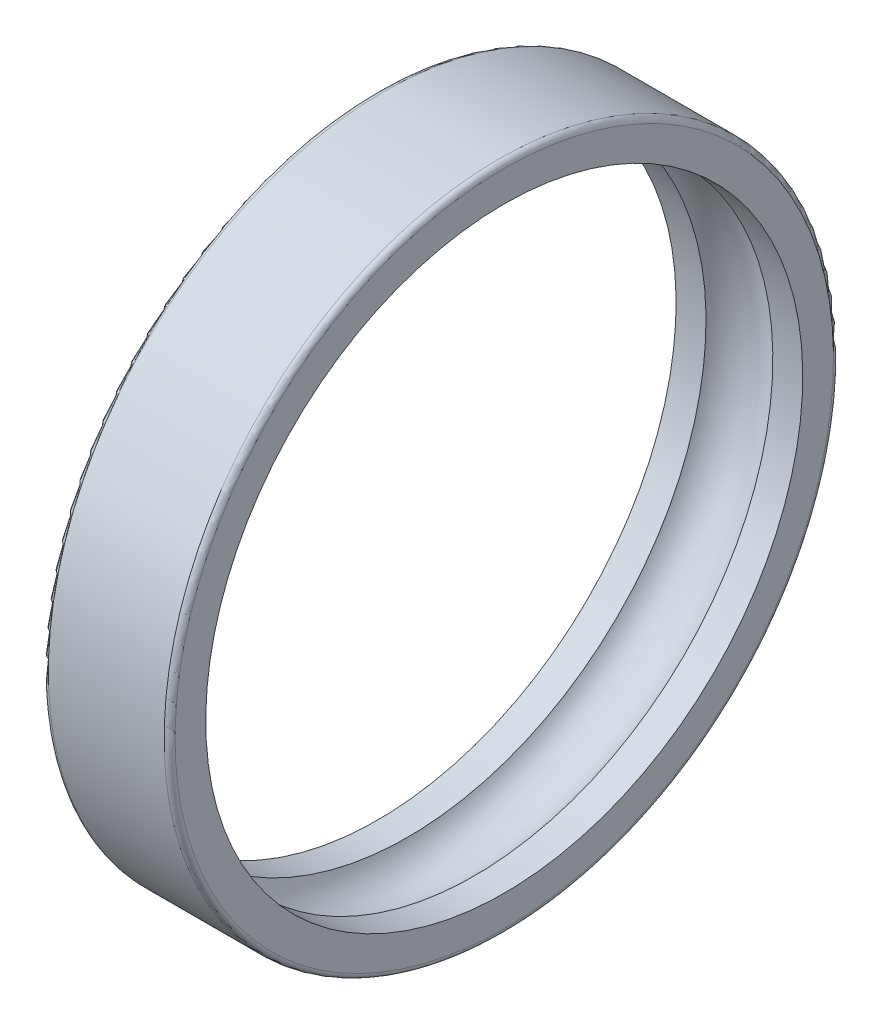
ISO-10303-21;
HEADER;
FILE_DESCRIPTION(('STEP AP214'),'2;1');
FILE_NAME('part.step','',(''),(''),'','','');
FILE_SCHEMA(('AUTOMOTIVE_DESIGN { 1 0 10303 214 1 1 1 1 }'));
ENDSEC;
DATA;
#1=APPLICATION_CONTEXT('core data for automotive mechanical design processes');
#2=APPLICATION_PROTOCOL_DEFINITION('international standard','automotive_design',2000,#1);
#3=PRODUCT_CONTEXT('',#1,'mechanical');
#4=PRODUCT('Part','Part','',(#3));
#5=PRODUCT_RELATED_PRODUCT_CATEGORY('part','',(#4));
#6=PRODUCT_DEFINITION_FORMATION('','',#4);
#7=PRODUCT_DEFINITION_CONTEXT('part definition',#1,'design');
#8=PRODUCT_DEFINITION('design','',#6,#7);
#9=PRODUCT_DEFINITION_SHAPE('','',#8);
#10=(LENGTH_UNIT() NAMED_UNIT(*) SI_UNIT(.MILLI.,.METRE.));
#11=(NAMED_UNIT(*) PLANE_ANGLE_UNIT() SI_UNIT($,.RADIAN.));
#12=(NAMED_UNIT(*) SI_UNIT($,.STERADIAN.) SOLID_ANGLE_UNIT());
#13=UNCERTAINTY_MEASURE_WITH_UNIT(LENGTH_MEASURE(1.E-05),#10,'distance_accuracy_value','');
#14=(GEOMETRIC_REPRESENTATION_CONTEXT(3) GLOBAL_UNCERTAINTY_ASSIGNED_CONTEXT((#13)) GLOBAL_UNIT_ASSIGNED_CONTEXT((#10,
#11,#12)) REPRESENTATION_CONTEXT('',''));
#15=CARTESIAN_POINT('',(0.,0.,0.));
#16=DIRECTION('',(0.,0.,1.));
#17=DIRECTION('',(1.,0.,0.));
#18=AXIS2_PLACEMENT_3D('',#15,#16,#17);
#19=CARTESIAN_POINT('',(0.,0.,0.));
#20=DIRECTION('',(1.,0.,0.));
#21=DIRECTION('',(0.,0.,-1.));
#22=AXIS2_PLACEMENT_3D('',#19,#20,#21);
#23=TOROIDAL_SURFACE('',#22,15.5,2.1);
#24=CARTESIAN_POINT('',(1.84661853126194,0.,0.));
#25=DIRECTION('',(1.,0.,0.));
#26=DIRECTION('',(0.,1.,0.));
#27=AXIS2_PLACEMENT_3D('',#24,#25,#26);
#28=CIRCLE('',#27,16.5);
#29=CARTESIAN_POINT('',(1.84661853126194,16.5,0.));
#30=VERTEX_POINT('',#29);
#31=EDGE_CURVE('E11',#30,#30,#28,.T.);
#32=ORIENTED_EDGE('',*,*,#31,.T.);
#33=EDGE_LOOP('',(#32));
#34=FACE_BOUND('',#33,.T.);
#35=CARTESIAN_POINT('',(-1.84661853126194,0.,0.));
#36=DIRECTION('',(1.,0.,0.));
#37=DIRECTION('',(0.,1.,0.));
#38=AXIS2_PLACEMENT_3D('',#35,#36,#37);
#39=CIRCLE('',#38,16.5);
#40=CARTESIAN_POINT('',(-1.84661853126194,16.5,0.));
#41=VERTEX_POINT('',#40);
#42=EDGE_CURVE('E64',#41,#41,#39,.T.);
#43=ORIENTED_EDGE('',*,*,#42,.F.);
#44=EDGE_LOOP('',(#43));
#45=FACE_BOUND('',#44,.T.);
#46=ADVANCED_FACE('F16',(#34,#45),#23,.F.);
#47=CARTESIAN_POINT('',(2.67330926563097,0.,0.));
#48=DIRECTION('',(-1.,0.,0.));
#49=DIRECTION('',(0.,1.,0.));
#50=AXIS2_PLACEMENT_3D('',#47,#48,#49);
#51=CYLINDRICAL_SURFACE('',#50,16.5);
#52=CARTESIAN_POINT('',(3.5,0.,0.));
#53=DIRECTION('',(1.,0.,0.));
#54=DIRECTION('',(0.,1.,0.));
#55=AXIS2_PLACEMENT_3D('',#52,#53,#54);
#56=CIRCLE('',#55,16.5);
#57=CARTESIAN_POINT('',(3.5,16.5,0.));
#58=VERTEX_POINT('',#57);
#59=EDGE_CURVE('E26',#58,#58,#56,.T.);
#60=ORIENTED_EDGE('',*,*,#59,.T.);
#61=EDGE_LOOP('',(#60));
#62=FACE_BOUND('',#61,.T.);
#63=ORIENTED_EDGE('',*,*,#31,.F.);
#64=EDGE_LOOP('',(#63));
#65=FACE_BOUND('',#64,.T.);
#66=ADVANCED_FACE('F74',(#62,#65),#51,.F.);
#67=CARTESIAN_POINT('',(3.5,17.35,0.));
#68=DIRECTION('',(1.,0.,0.));
#69=DIRECTION('',(0.,1.,0.));
#70=AXIS2_PLACEMENT_3D('',#67,#68,#69);
#71=PLANE('',#70);
#72=CARTESIAN_POINT('',(3.5,0.,0.));
#73=DIRECTION('',(1.,0.,0.));
#74=DIRECTION('',(0.,1.,0.));
#75=AXIS2_PLACEMENT_3D('',#72,#73,#74);
#76=CIRCLE('',#75,18.2);
#77=CARTESIAN_POINT('',(3.5,18.2,0.));
#78=VERTEX_POINT('',#77);
#79=EDGE_CURVE('E56',#78,#78,#76,.T.);
#80=ORIENTED_EDGE('',*,*,#79,.T.);
#81=EDGE_LOOP('',(#80));
#82=FACE_BOUND('',#81,.T.);
#83=ORIENTED_EDGE('',*,*,#59,.F.);
#84=EDGE_LOOP('',(#83));
#85=FACE_BOUND('',#84,.T.);
#86=ADVANCED_FACE('F57',(#82,#85),#71,.T.);
#87=CARTESIAN_POINT('',(3.2,0.,0.));
#88=DIRECTION('',(1.,0.,0.));
#89=DIRECTION('',(0.,0.,-1.));
#90=AXIS2_PLACEMENT_3D('',#87,#88,#89);
#91=TOROIDAL_SURFACE('',#90,18.2,0.3);
#92=CARTESIAN_POINT('',(3.2,0.,0.));
#93=DIRECTION('',(1.,0.,0.));
#94=DIRECTION('',(0.,1.,0.));
#95=AXIS2_PLACEMENT_3D('',#92,#93,#94);
#96=CIRCLE('',#95,18.5);
#97=CARTESIAN_POINT('',(3.2,18.5,0.));
#98=VERTEX_POINT('',#97);
#99=EDGE_CURVE('E60',#98,#98,#96,.T.);
#100=ORIENTED_EDGE('',*,*,#99,.T.);
#101=EDGE_LOOP('',(#100));
#102=FACE_BOUND('',#101,.T.);
#103=ORIENTED_EDGE('',*,*,#79,.F.);
#104=EDGE_LOOP('',(#103));
#105=FACE_BOUND('',#104,.T.);
#106=ADVANCED_FACE('F88',(#102,#105),#91,.T.);
#107=CARTESIAN_POINT('',(0.,0.,0.));
#108=DIRECTION('',(-1.,0.,0.));
#109=DIRECTION('',(0.,1.,0.));
#110=AXIS2_PLACEMENT_3D('',#107,#108,#109);
#111=CYLINDRICAL_SURFACE('',#110,18.5);
#112=CARTESIAN_POINT('',(-3.2,0.,0.));
#113=DIRECTION('',(1.,0.,0.));
#114=DIRECTION('',(0.,1.,0.));
#115=AXIS2_PLACEMENT_3D('',#112,#113,#114);
#116=CIRCLE('',#115,18.5);
#117=CARTESIAN_POINT('',(-3.2,18.5,0.));
#118=VERTEX_POINT('',#117);
#119=EDGE_CURVE('E20',#118,#118,#116,.T.);
#120=ORIENTED_EDGE('',*,*,#119,.T.);
#121=EDGE_LOOP('',(#120));
#122=FACE_BOUND('',#121,.T.);
#123=ORIENTED_EDGE('',*,*,#99,.F.);
#124=EDGE_LOOP('',(#123));
#125=FACE_BOUND('',#124,.T.);
#126=ADVANCED_FACE('F18',(#122,#125),#111,.T.);
#127=CARTESIAN_POINT('',(-3.2,0.,0.));
#128=DIRECTION('',(1.,0.,0.));
#129=DIRECTION('',(0.,0.,-1.));
#130=AXIS2_PLACEMENT_3D('',#127,#128,#129);
#131=TOROIDAL_SURFACE('',#130,18.2,0.3);
#132=CARTESIAN_POINT('',(-3.5,0.,0.));
#133=DIRECTION('',(1.,0.,0.));
#134=DIRECTION('',(0.,1.,0.));
#135=AXIS2_PLACEMENT_3D('',#132,#133,#134);
#136=CIRCLE('',#135,18.2);
#137=CARTESIAN_POINT('',(-3.5,18.2,0.));
#138=VERTEX_POINT('',#137);
#139=EDGE_CURVE('E50',#138,#138,#136,.T.);
#140=ORIENTED_EDGE('',*,*,#139,.T.);
#141=EDGE_LOOP('',(#140));
#142=FACE_BOUND('',#141,.T.);
#143=ORIENTED_EDGE('',*,*,#119,.F.);
#144=EDGE_LOOP('',(#143));
#145=FACE_BOUND('',#144,.T.);
#146=ADVANCED_FACE('F84',(#142,#145),#131,.T.);
#147=CARTESIAN_POINT('',(-3.5,17.35,0.));
#148=DIRECTION('',(-1.,0.,0.));
#149=DIRECTION('',(0.,-1.,0.));
#150=AXIS2_PLACEMENT_3D('',#147,#148,#149);
#151=PLANE('',#150);
#152=CARTESIAN_POINT('',(-3.5,0.,0.));
#153=DIRECTION('',(1.,0.,0.));
#154=DIRECTION('',(0.,1.,0.));
#155=AXIS2_PLACEMENT_3D('',#152,#153,#154);
#156=CIRCLE('',#155,16.5);
#157=CARTESIAN_POINT('',(-3.5,16.5,0.));
#158=VERTEX_POINT('',#157);
#159=EDGE_CURVE('E66',#158,#158,#156,.T.);
#160=ORIENTED_EDGE('',*,*,#159,.T.);
#161=EDGE_LOOP('',(#160));
#162=FACE_BOUND('',#161,.T.);
#163=ORIENTED_EDGE('',*,*,#139,.F.);
#164=EDGE_LOOP('',(#163));
#165=FACE_BOUND('',#164,.T.);
#166=ADVANCED_FACE('F86',(#162,#165),#151,.T.);
#167=CARTESIAN_POINT('',(-2.67330926563097,0.,0.));
#168=DIRECTION('',(-1.,0.,0.));
#169=DIRECTION('',(0.,1.,0.));
#170=AXIS2_PLACEMENT_3D('',#167,#168,#169);
#171=CYLINDRICAL_SURFACE('',#170,16.5);
#172=ORIENTED_EDGE('',*,*,#42,.T.);
#173=EDGE_LOOP('',(#172));
#174=FACE_BOUND('',#173,.T.);
#175=ORIENTED_EDGE('',*,*,#159,.F.);
#176=EDGE_LOOP('',(#175));
#177=FACE_BOUND('',#176,.T.);
#178=ADVANCED_FACE('F70',(#174,#177),#171,.F.);
#179=CLOSED_SHELL('',(#46,#66,#86,#106,#126,#146,#166,#178));
#180=MANIFOLD_SOLID_BREP('B1',#179);
#181=ADVANCED_BREP_SHAPE_REPRESENTATION('',(#18,#180),#14);
#182=SHAPE_DEFINITION_REPRESENTATION(#9,#181);
ENDSEC;
END-ISO-10303-21;
